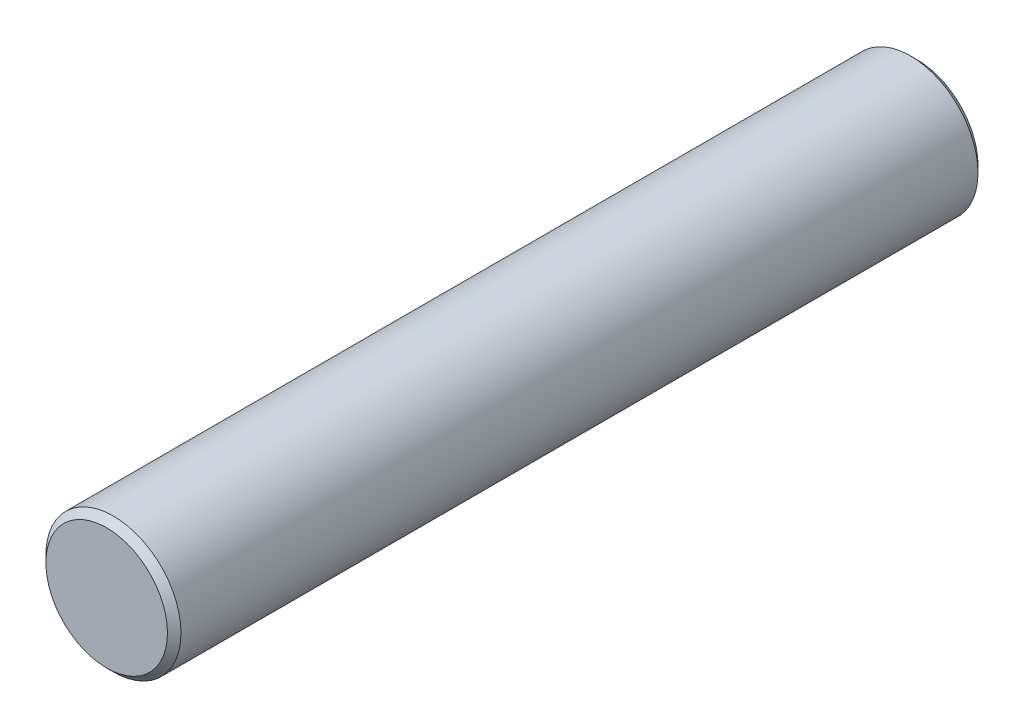
ISO-10303-21;
HEADER;
FILE_DESCRIPTION(('STEP AP214'),'2;1');
FILE_NAME('part.step','',(''),(''),'','','');
FILE_SCHEMA(('AUTOMOTIVE_DESIGN { 1 0 10303 214 1 1 1 1 }'));
ENDSEC;
DATA;
#1=APPLICATION_CONTEXT('core data for automotive mechanical design processes');
#2=APPLICATION_PROTOCOL_DEFINITION('international standard','automotive_design',2000,#1);
#3=PRODUCT_CONTEXT('',#1,'mechanical');
#4=PRODUCT('Part','Part','',(#3));
#5=PRODUCT_RELATED_PRODUCT_CATEGORY('part','',(#4));
#6=PRODUCT_DEFINITION_FORMATION('','',#4);
#7=PRODUCT_DEFINITION_CONTEXT('part definition',#1,'design');
#8=PRODUCT_DEFINITION('design','',#6,#7);
#9=PRODUCT_DEFINITION_SHAPE('','',#8);
#10=(LENGTH_UNIT() NAMED_UNIT(*) SI_UNIT(.MILLI.,.METRE.));
#11=(NAMED_UNIT(*) PLANE_ANGLE_UNIT() SI_UNIT($,.RADIAN.));
#12=(NAMED_UNIT(*) SI_UNIT($,.STERADIAN.) SOLID_ANGLE_UNIT());
#13=UNCERTAINTY_MEASURE_WITH_UNIT(LENGTH_MEASURE(1.E-05),#10,'distance_accuracy_value','');
#14=(GEOMETRIC_REPRESENTATION_CONTEXT(3) GLOBAL_UNCERTAINTY_ASSIGNED_CONTEXT((#13)) GLOBAL_UNIT_ASSIGNED_CONTEXT((#10,
#11,#12)) REPRESENTATION_CONTEXT('',''));
#15=CARTESIAN_POINT('',(0.,0.,0.));
#16=DIRECTION('',(0.,0.,1.));
#17=DIRECTION('',(1.,0.,0.));
#18=AXIS2_PLACEMENT_3D('',#15,#16,#17);
#19=CARTESIAN_POINT('',(0.,0.,30.));
#20=DIRECTION('',(0.,0.,-1.));
#21=DIRECTION('',(-1.,0.,0.));
#22=AXIS2_PLACEMENT_3D('',#19,#20,#21);
#23=CYLINDRICAL_SURFACE('',#22,2.5);
#24=CARTESIAN_POINT('',(0.,0.,0.250000000000004));
#25=DIRECTION('',(0.,0.,1.));
#26=DIRECTION('',(1.,0.,0.));
#27=AXIS2_PLACEMENT_3D('',#24,#25,#26);
#28=CIRCLE('',#27,2.5);
#29=CARTESIAN_POINT('',(2.5,0.,0.250000000000004));
#30=VERTEX_POINT('',#29);
#31=EDGE_CURVE('E45',#30,#30,#28,.T.);
#32=ORIENTED_EDGE('',*,*,#31,.T.);
#33=EDGE_LOOP('',(#32));
#34=FACE_BOUND('',#33,.T.);
#35=CARTESIAN_POINT('',(0.,0.,29.75));
#36=DIRECTION('',(0.,0.,1.));
#37=DIRECTION('',(1.,0.,0.));
#38=AXIS2_PLACEMENT_3D('',#35,#36,#37);
#39=CIRCLE('',#38,2.5);
#40=CARTESIAN_POINT('',(2.5,0.,29.75));
#41=VERTEX_POINT('',#40);
#42=EDGE_CURVE('E49',#41,#41,#39,.F.);
#43=ORIENTED_EDGE('',*,*,#42,.T.);
#44=EDGE_LOOP('',(#43));
#45=FACE_BOUND('',#44,.T.);
#46=ADVANCED_FACE('F34',(#34,#45),#23,.T.);
#47=CARTESIAN_POINT('',(0.,0.,30.));
#48=DIRECTION('',(0.,0.,1.));
#49=DIRECTION('',(1.,0.,0.));
#50=AXIS2_PLACEMENT_3D('',#47,#48,#49);
#51=PLANE('',#50);
#52=CARTESIAN_POINT('',(0.,0.,30.));
#53=DIRECTION('',(0.,0.,1.));
#54=DIRECTION('',(1.,0.,0.));
#55=AXIS2_PLACEMENT_3D('',#52,#53,#54);
#56=CIRCLE('',#55,2.25);
#57=CARTESIAN_POINT('',(2.25,0.,30.));
#58=VERTEX_POINT('',#57);
#59=EDGE_CURVE('E10',#58,#58,#56,.T.);
#60=ORIENTED_EDGE('',*,*,#59,.T.);
#61=EDGE_LOOP('',(#60));
#62=FACE_BOUND('',#61,.T.);
#63=ADVANCED_FACE('F65',(#62),#51,.T.);
#64=CARTESIAN_POINT('',(0.,0.,0.));
#65=DIRECTION('',(0.,0.,1.));
#66=DIRECTION('',(1.,0.,0.));
#67=AXIS2_PLACEMENT_3D('',#64,#65,#66);
#68=PLANE('',#67);
#69=CARTESIAN_POINT('',(0.,0.,0.));
#70=DIRECTION('',(0.,0.,1.));
#71=DIRECTION('',(1.,0.,0.));
#72=AXIS2_PLACEMENT_3D('',#69,#70,#71);
#73=CIRCLE('',#72,2.25);
#74=CARTESIAN_POINT('',(2.25,0.,0.));
#75=VERTEX_POINT('',#74);
#76=EDGE_CURVE('E41',#75,#75,#73,.F.);
#77=ORIENTED_EDGE('',*,*,#76,.T.);
#78=EDGE_LOOP('',(#77));
#79=FACE_BOUND('',#78,.T.);
#80=ADVANCED_FACE('F62',(#79),#68,.F.);
#81=CARTESIAN_POINT('',(0.,0.,0.250000000000004));
#82=DIRECTION('',(0.,0.,1.));
#83=DIRECTION('',(1.,0.,0.));
#84=AXIS2_PLACEMENT_3D('',#81,#82,#83);
#85=CONICAL_SURFACE('',#84,2.5,0.785398163397444);
#86=ORIENTED_EDGE('',*,*,#76,.F.);
#87=EDGE_LOOP('',(#86));
#88=FACE_BOUND('',#87,.T.);
#89=ORIENTED_EDGE('',*,*,#31,.F.);
#90=EDGE_LOOP('',(#89));
#91=FACE_BOUND('',#90,.T.);
#92=ADVANCED_FACE('F58',(#88,#91),#85,.T.);
#93=CARTESIAN_POINT('',(0.,0.,30.));
#94=DIRECTION('',(0.,0.,-1.));
#95=DIRECTION('',(-1.,0.,0.));
#96=AXIS2_PLACEMENT_3D('',#93,#94,#95);
#97=CONICAL_SURFACE('',#96,2.25,0.785398163397444);
#98=ORIENTED_EDGE('',*,*,#42,.F.);
#99=EDGE_LOOP('',(#98));
#100=FACE_BOUND('',#99,.T.);
#101=ORIENTED_EDGE('',*,*,#59,.F.);
#102=EDGE_LOOP('',(#101));
#103=FACE_BOUND('',#102,.T.);
#104=ADVANCED_FACE('F36',(#100,#103),#97,.T.);
#105=CLOSED_SHELL('',(#46,#63,#80,#92,#104));
#106=MANIFOLD_SOLID_BREP('B2',#105);
#107=ADVANCED_BREP_SHAPE_REPRESENTATION('',(#18,#106),#14);
#108=SHAPE_DEFINITION_REPRESENTATION(#9,#107);
ENDSEC;
END-ISO-10303-21;
